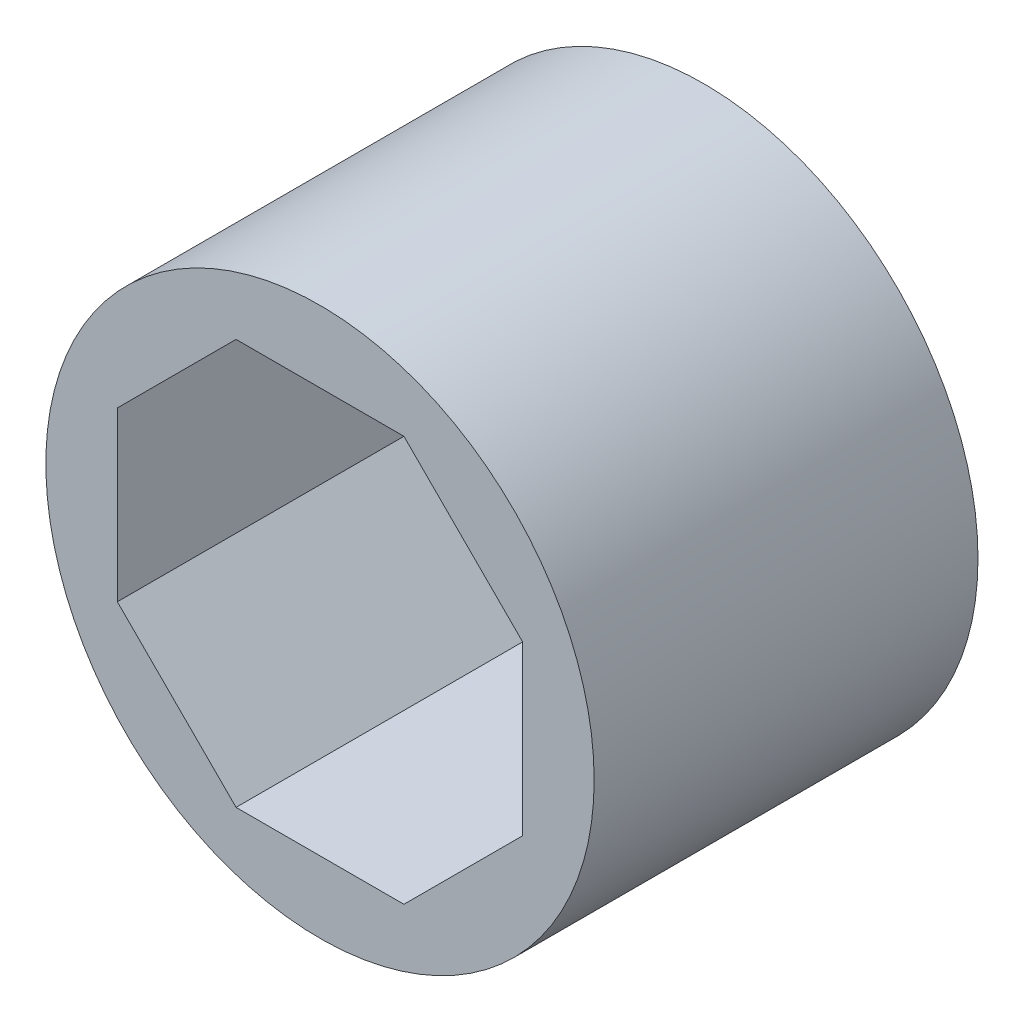
ISO-10303-21;
HEADER;
FILE_DESCRIPTION(('STEP AP214'),'2;1');
FILE_NAME('part.step','',(''),(''),'','','');
FILE_SCHEMA(('AUTOMOTIVE_DESIGN { 1 0 10303 214 1 1 1 1 }'));
ENDSEC;
DATA;
#1=APPLICATION_CONTEXT('core data for automotive mechanical design processes');
#2=APPLICATION_PROTOCOL_DEFINITION('international standard','automotive_design',2000,#1);
#3=PRODUCT_CONTEXT('',#1,'mechanical');
#4=PRODUCT('Part','Part','',(#3));
#5=PRODUCT_RELATED_PRODUCT_CATEGORY('part','',(#4));
#6=PRODUCT_DEFINITION_FORMATION('','',#4);
#7=PRODUCT_DEFINITION_CONTEXT('part definition',#1,'design');
#8=PRODUCT_DEFINITION('design','',#6,#7);
#9=PRODUCT_DEFINITION_SHAPE('','',#8);
#10=(LENGTH_UNIT() NAMED_UNIT(*) SI_UNIT(.MILLI.,.METRE.));
#11=(NAMED_UNIT(*) PLANE_ANGLE_UNIT() SI_UNIT($,.RADIAN.));
#12=(NAMED_UNIT(*) SI_UNIT($,.STERADIAN.) SOLID_ANGLE_UNIT());
#13=UNCERTAINTY_MEASURE_WITH_UNIT(LENGTH_MEASURE(1.E-05),#10,'distance_accuracy_value','');
#14=(GEOMETRIC_REPRESENTATION_CONTEXT(3) GLOBAL_UNCERTAINTY_ASSIGNED_CONTEXT((#13)) GLOBAL_UNIT_ASSIGNED_CONTEXT((#10,
#11,#12)) REPRESENTATION_CONTEXT('',''));
#15=CARTESIAN_POINT('',(0.,0.,0.));
#16=DIRECTION('',(0.,0.,1.));
#17=DIRECTION('',(1.,0.,0.));
#18=AXIS2_PLACEMENT_3D('',#15,#16,#17);
#19=CARTESIAN_POINT('',(0.,0.,7.));
#20=DIRECTION('',(0.,0.,1.));
#21=DIRECTION('',(1.,0.,0.));
#22=AXIS2_PLACEMENT_3D('',#19,#20,#21);
#23=PLANE('',#22);
#24=CARTESIAN_POINT('',(0.,0.,7.));
#25=DIRECTION('',(0.,0.,1.));
#26=DIRECTION('',(1.,0.,0.));
#27=AXIS2_PLACEMENT_3D('',#24,#25,#26);
#28=CIRCLE('',#27,5.);
#29=CARTESIAN_POINT('',(5.,0.,7.));
#30=VERTEX_POINT('',#29);
#31=EDGE_CURVE('E11',#30,#30,#28,.T.);
#32=ORIENTED_EDGE('',*,*,#31,.T.);
#33=EDGE_LOOP('',(#32));
#34=FACE_BOUND('',#33,.T.);
#35=DIRECTION('',(-1.,0.,0.));
#36=VECTOR('',#35,1.);
#37=CARTESIAN_POINT('',(1.53073372946036,3.69551813004515,7.));
#38=LINE('',#37,#36);
#39=CARTESIAN_POINT('',(1.53073372946036,3.69551813004515,7.));
#40=VERTEX_POINT('',#39);
#41=CARTESIAN_POINT('',(-1.53073372946036,3.69551813004515,7.));
#42=VERTEX_POINT('',#41);
#43=EDGE_CURVE('E114',#40,#42,#38,.T.);
#44=ORIENTED_EDGE('',*,*,#43,.F.);
#45=DIRECTION('',(-0.707106781186548,0.707106781186548,0.));
#46=VECTOR('',#45,1.);
#47=CARTESIAN_POINT('',(3.69551813004515,1.53073372946036,7.));
#48=LINE('',#47,#46);
#49=CARTESIAN_POINT('',(3.69551813004515,1.53073372946036,7.));
#50=VERTEX_POINT('',#49);
#51=EDGE_CURVE('E105',#50,#40,#48,.T.);
#52=ORIENTED_EDGE('',*,*,#51,.F.);
#53=DIRECTION('',(0.,1.,0.));
#54=VECTOR('',#53,1.);
#55=CARTESIAN_POINT('',(3.69551813004515,-1.53073372946036,7.));
#56=LINE('',#55,#54);
#57=CARTESIAN_POINT('',(3.69551813004515,-1.53073372946036,7.));
#58=VERTEX_POINT('',#57);
#59=EDGE_CURVE('E145',#58,#50,#56,.T.);
#60=ORIENTED_EDGE('',*,*,#59,.F.);
#61=DIRECTION('',(0.707106781186548,0.707106781186547,0.));
#62=VECTOR('',#61,1.);
#63=CARTESIAN_POINT('',(1.53073372946036,-3.69551813004515,7.));
#64=LINE('',#63,#62);
#65=CARTESIAN_POINT('',(1.53073372946036,-3.69551813004515,7.));
#66=VERTEX_POINT('',#65);
#67=EDGE_CURVE('E142',#66,#58,#64,.T.);
#68=ORIENTED_EDGE('',*,*,#67,.F.);
#69=DIRECTION('',(1.,0.,0.));
#70=VECTOR('',#69,1.);
#71=CARTESIAN_POINT('',(-1.53073372946036,-3.69551813004515,7.));
#72=LINE('',#71,#70);
#73=CARTESIAN_POINT('',(-1.53073372946036,-3.69551813004515,7.));
#74=VERTEX_POINT('',#73);
#75=EDGE_CURVE('E139',#74,#66,#72,.T.);
#76=ORIENTED_EDGE('',*,*,#75,.F.);
#77=DIRECTION('',(0.707106781186548,-0.707106781186547,0.));
#78=VECTOR('',#77,1.);
#79=CARTESIAN_POINT('',(-3.69551813004515,-1.53073372946036,7.));
#80=LINE('',#79,#78);
#81=CARTESIAN_POINT('',(-3.69551813004515,-1.53073372946036,7.));
#82=VERTEX_POINT('',#81);
#83=EDGE_CURVE('E136',#82,#74,#80,.T.);
#84=ORIENTED_EDGE('',*,*,#83,.F.);
#85=DIRECTION('',(0.,-1.,0.));
#86=VECTOR('',#85,1.);
#87=CARTESIAN_POINT('',(-3.69551813004515,1.53073372946036,7.));
#88=LINE('',#87,#86);
#89=CARTESIAN_POINT('',(-3.69551813004515,1.53073372946036,7.));
#90=VERTEX_POINT('',#89);
#91=EDGE_CURVE('E131',#90,#82,#88,.T.);
#92=ORIENTED_EDGE('',*,*,#91,.F.);
#93=DIRECTION('',(-0.707106781186547,-0.707106781186548,0.));
#94=VECTOR('',#93,1.);
#95=CARTESIAN_POINT('',(-1.53073372946036,3.69551813004515,7.));
#96=LINE('',#95,#94);
#97=EDGE_CURVE('E127',#42,#90,#96,.T.);
#98=ORIENTED_EDGE('',*,*,#97,.F.);
#99=EDGE_LOOP('',(#44,#52,#60,#68,#76,#84,#92,#98));
#100=FACE_BOUND('',#99,.T.);
#101=ADVANCED_FACE('F39',(#34,#100),#23,.T.);
#102=CARTESIAN_POINT('',(0.,0.,0.));
#103=DIRECTION('',(0.,0.,1.));
#104=DIRECTION('',(1.,0.,0.));
#105=AXIS2_PLACEMENT_3D('',#102,#103,#104);
#106=PLANE('',#105);
#107=CARTESIAN_POINT('',(0.,0.,0.));
#108=DIRECTION('',(0.,0.,1.));
#109=DIRECTION('',(1.,0.,0.));
#110=AXIS2_PLACEMENT_3D('',#107,#108,#109);
#111=CIRCLE('',#110,5.);
#112=CARTESIAN_POINT('',(5.,0.,0.));
#113=VERTEX_POINT('',#112);
#114=EDGE_CURVE('E43',#113,#113,#111,.T.);
#115=ORIENTED_EDGE('',*,*,#114,.F.);
#116=EDGE_LOOP('',(#115));
#117=FACE_BOUND('',#116,.T.);
#118=DIRECTION('',(-0.707106781186548,0.707106781186548,0.));
#119=VECTOR('',#118,1.);
#120=CARTESIAN_POINT('',(3.69551813004515,1.53073372946036,0.));
#121=LINE('',#120,#119);
#122=CARTESIAN_POINT('',(3.69551813004515,1.53073372946036,0.));
#123=VERTEX_POINT('',#122);
#124=CARTESIAN_POINT('',(1.53073372946036,3.69551813004515,0.));
#125=VERTEX_POINT('',#124);
#126=EDGE_CURVE('E63',#123,#125,#121,.T.);
#127=ORIENTED_EDGE('',*,*,#126,.T.);
#128=DIRECTION('',(-1.,0.,0.));
#129=VECTOR('',#128,1.);
#130=CARTESIAN_POINT('',(1.53073372946036,3.69551813004515,0.));
#131=LINE('',#130,#129);
#132=CARTESIAN_POINT('',(-1.53073372946036,3.69551813004515,0.));
#133=VERTEX_POINT('',#132);
#134=EDGE_CURVE('E121',#125,#133,#131,.T.);
#135=ORIENTED_EDGE('',*,*,#134,.T.);
#136=DIRECTION('',(-0.707106781186547,-0.707106781186548,0.));
#137=VECTOR('',#136,1.);
#138=CARTESIAN_POINT('',(-1.53073372946036,3.69551813004515,0.));
#139=LINE('',#138,#137);
#140=CARTESIAN_POINT('',(-3.69551813004515,1.53073372946036,0.));
#141=VERTEX_POINT('',#140);
#142=EDGE_CURVE('E152',#133,#141,#139,.T.);
#143=ORIENTED_EDGE('',*,*,#142,.T.);
#144=DIRECTION('',(0.,-1.,0.));
#145=VECTOR('',#144,1.);
#146=CARTESIAN_POINT('',(-3.69551813004515,1.53073372946036,0.));
#147=LINE('',#146,#145);
#148=CARTESIAN_POINT('',(-3.69551813004515,-1.53073372946036,0.));
#149=VERTEX_POINT('',#148);
#150=EDGE_CURVE('E156',#141,#149,#147,.T.);
#151=ORIENTED_EDGE('',*,*,#150,.T.);
#152=DIRECTION('',(0.707106781186548,-0.707106781186547,0.));
#153=VECTOR('',#152,1.);
#154=CARTESIAN_POINT('',(-3.69551813004515,-1.53073372946036,0.));
#155=LINE('',#154,#153);
#156=CARTESIAN_POINT('',(-1.53073372946036,-3.69551813004515,0.));
#157=VERTEX_POINT('',#156);
#158=EDGE_CURVE('E160',#149,#157,#155,.T.);
#159=ORIENTED_EDGE('',*,*,#158,.T.);
#160=DIRECTION('',(1.,0.,0.));
#161=VECTOR('',#160,1.);
#162=CARTESIAN_POINT('',(-1.53073372946036,-3.69551813004515,0.));
#163=LINE('',#162,#161);
#164=CARTESIAN_POINT('',(1.53073372946036,-3.69551813004515,0.));
#165=VERTEX_POINT('',#164);
#166=EDGE_CURVE('E164',#157,#165,#163,.T.);
#167=ORIENTED_EDGE('',*,*,#166,.T.);
#168=DIRECTION('',(0.707106781186548,0.707106781186547,0.));
#169=VECTOR('',#168,1.);
#170=CARTESIAN_POINT('',(1.53073372946036,-3.69551813004515,0.));
#171=LINE('',#170,#169);
#172=CARTESIAN_POINT('',(3.69551813004515,-1.53073372946036,0.));
#173=VERTEX_POINT('',#172);
#174=EDGE_CURVE('E168',#165,#173,#171,.T.);
#175=ORIENTED_EDGE('',*,*,#174,.T.);
#176=DIRECTION('',(0.,1.,0.));
#177=VECTOR('',#176,1.);
#178=CARTESIAN_POINT('',(3.69551813004515,-1.53073372946036,0.));
#179=LINE('',#178,#177);
#180=EDGE_CURVE('E115',#173,#123,#179,.T.);
#181=ORIENTED_EDGE('',*,*,#180,.T.);
#182=EDGE_LOOP('',(#127,#135,#143,#151,#159,#167,#175,#181));
#183=FACE_BOUND('',#182,.T.);
#184=ADVANCED_FACE('F198',(#117,#183),#106,.F.);
#185=CARTESIAN_POINT('',(0.,0.,7.));
#186=DIRECTION('',(0.,0.,-1.));
#187=DIRECTION('',(-1.,0.,0.));
#188=AXIS2_PLACEMENT_3D('',#185,#186,#187);
#189=CYLINDRICAL_SURFACE('',#188,5.);
#190=ORIENTED_EDGE('',*,*,#31,.F.);
#191=EDGE_LOOP('',(#190));
#192=FACE_BOUND('',#191,.T.);
#193=ORIENTED_EDGE('',*,*,#114,.T.);
#194=EDGE_LOOP('',(#193));
#195=FACE_BOUND('',#194,.T.);
#196=ADVANCED_FACE('F41',(#192,#195),#189,.T.);
#197=CARTESIAN_POINT('',(3.69551813004515,1.53073372946036,7.));
#198=DIRECTION('',(-0.707106781186547,-0.707106781186547,0.));
#199=DIRECTION('',(0.707106781186548,-0.707106781186548,0.));
#200=AXIS2_PLACEMENT_3D('',#197,#198,#199);
#201=PLANE('',#200);
#202=ORIENTED_EDGE('',*,*,#126,.F.);
#203=DIRECTION('',(0.,0.,-1.));
#204=VECTOR('',#203,1.);
#205=CARTESIAN_POINT('',(3.69551813004515,1.53073372946036,7.));
#206=LINE('',#205,#204);
#207=EDGE_CURVE('E109',#50,#123,#206,.T.);
#208=ORIENTED_EDGE('',*,*,#207,.F.);
#209=ORIENTED_EDGE('',*,*,#51,.T.);
#210=DIRECTION('',(0.,0.,-1.));
#211=VECTOR('',#210,1.);
#212=CARTESIAN_POINT('',(1.53073372946036,3.69551813004515,7.));
#213=LINE('',#212,#211);
#214=EDGE_CURVE('E108',#40,#125,#213,.T.);
#215=ORIENTED_EDGE('',*,*,#214,.T.);
#216=EDGE_LOOP('',(#202,#208,#209,#215));
#217=FACE_BOUND('',#216,.T.);
#218=ADVANCED_FACE('F107',(#217),#201,.T.);
#219=CARTESIAN_POINT('',(1.53073372946036,3.69551813004515,7.));
#220=DIRECTION('',(0.,-1.,0.));
#221=DIRECTION('',(1.,0.,0.));
#222=AXIS2_PLACEMENT_3D('',#219,#220,#221);
#223=PLANE('',#222);
#224=ORIENTED_EDGE('',*,*,#134,.F.);
#225=ORIENTED_EDGE('',*,*,#214,.F.);
#226=ORIENTED_EDGE('',*,*,#43,.T.);
#227=DIRECTION('',(0.,0.,-1.));
#228=VECTOR('',#227,1.);
#229=CARTESIAN_POINT('',(-1.53073372946036,3.69551813004515,7.));
#230=LINE('',#229,#228);
#231=EDGE_CURVE('E123',#42,#133,#230,.T.);
#232=ORIENTED_EDGE('',*,*,#231,.T.);
#233=EDGE_LOOP('',(#224,#225,#226,#232));
#234=FACE_BOUND('',#233,.T.);
#235=ADVANCED_FACE('F118',(#234),#223,.T.);
#236=CARTESIAN_POINT('',(-1.53073372946036,3.69551813004515,7.));
#237=DIRECTION('',(0.707106781186548,-0.707106781186547,0.));
#238=DIRECTION('',(0.707106781186547,0.707106781186548,0.));
#239=AXIS2_PLACEMENT_3D('',#236,#237,#238);
#240=PLANE('',#239);
#241=ORIENTED_EDGE('',*,*,#142,.F.);
#242=ORIENTED_EDGE('',*,*,#231,.F.);
#243=ORIENTED_EDGE('',*,*,#97,.T.);
#244=DIRECTION('',(0.,0.,-1.));
#245=VECTOR('',#244,1.);
#246=CARTESIAN_POINT('',(-3.69551813004515,1.53073372946036,7.));
#247=LINE('',#246,#245);
#248=EDGE_CURVE('E188',#90,#141,#247,.T.);
#249=ORIENTED_EDGE('',*,*,#248,.T.);
#250=EDGE_LOOP('',(#241,#242,#243,#249));
#251=FACE_BOUND('',#250,.T.);
#252=ADVANCED_FACE('F194',(#251),#240,.T.);
#253=CARTESIAN_POINT('',(-3.69551813004515,1.53073372946036,7.));
#254=DIRECTION('',(1.,0.,0.));
#255=DIRECTION('',(0.,1.,0.));
#256=AXIS2_PLACEMENT_3D('',#253,#254,#255);
#257=PLANE('',#256);
#258=ORIENTED_EDGE('',*,*,#150,.F.);
#259=ORIENTED_EDGE('',*,*,#248,.F.);
#260=ORIENTED_EDGE('',*,*,#91,.T.);
#261=DIRECTION('',(0.,0.,-1.));
#262=VECTOR('',#261,1.);
#263=CARTESIAN_POINT('',(-3.69551813004515,-1.53073372946036,7.));
#264=LINE('',#263,#262);
#265=EDGE_CURVE('E185',#82,#149,#264,.T.);
#266=ORIENTED_EDGE('',*,*,#265,.T.);
#267=EDGE_LOOP('',(#258,#259,#260,#266));
#268=FACE_BOUND('',#267,.T.);
#269=ADVANCED_FACE('F216',(#268),#257,.T.);
#270=CARTESIAN_POINT('',(-3.69551813004515,-1.53073372946036,7.));
#271=DIRECTION('',(0.707106781186547,0.707106781186548,0.));
#272=DIRECTION('',(-0.707106781186548,0.707106781186547,0.));
#273=AXIS2_PLACEMENT_3D('',#270,#271,#272);
#274=PLANE('',#273);
#275=ORIENTED_EDGE('',*,*,#158,.F.);
#276=ORIENTED_EDGE('',*,*,#265,.F.);
#277=ORIENTED_EDGE('',*,*,#83,.T.);
#278=DIRECTION('',(0.,0.,-1.));
#279=VECTOR('',#278,1.);
#280=CARTESIAN_POINT('',(-1.53073372946036,-3.69551813004515,7.));
#281=LINE('',#280,#279);
#282=EDGE_CURVE('E182',#74,#157,#281,.T.);
#283=ORIENTED_EDGE('',*,*,#282,.T.);
#284=EDGE_LOOP('',(#275,#276,#277,#283));
#285=FACE_BOUND('',#284,.T.);
#286=ADVANCED_FACE('F213',(#285),#274,.T.);
#287=CARTESIAN_POINT('',(-1.53073372946036,-3.69551813004515,7.));
#288=DIRECTION('',(0.,1.,0.));
#289=DIRECTION('',(-1.,0.,0.));
#290=AXIS2_PLACEMENT_3D('',#287,#288,#289);
#291=PLANE('',#290);
#292=ORIENTED_EDGE('',*,*,#166,.F.);
#293=ORIENTED_EDGE('',*,*,#282,.F.);
#294=ORIENTED_EDGE('',*,*,#75,.T.);
#295=DIRECTION('',(0.,0.,-1.));
#296=VECTOR('',#295,1.);
#297=CARTESIAN_POINT('',(1.53073372946036,-3.69551813004515,7.));
#298=LINE('',#297,#296);
#299=EDGE_CURVE('E179',#66,#165,#298,.T.);
#300=ORIENTED_EDGE('',*,*,#299,.T.);
#301=EDGE_LOOP('',(#292,#293,#294,#300));
#302=FACE_BOUND('',#301,.T.);
#303=ADVANCED_FACE('F209',(#302),#291,.T.);
#304=CARTESIAN_POINT('',(1.53073372946036,-3.69551813004515,7.));
#305=DIRECTION('',(-0.707106781186547,0.707106781186548,0.));
#306=DIRECTION('',(-0.707106781186548,-0.707106781186547,0.));
#307=AXIS2_PLACEMENT_3D('',#304,#305,#306);
#308=PLANE('',#307);
#309=ORIENTED_EDGE('',*,*,#174,.F.);
#310=ORIENTED_EDGE('',*,*,#299,.F.);
#311=ORIENTED_EDGE('',*,*,#67,.T.);
#312=DIRECTION('',(0.,0.,-1.));
#313=VECTOR('',#312,1.);
#314=CARTESIAN_POINT('',(3.69551813004515,-1.53073372946036,7.));
#315=LINE('',#314,#313);
#316=EDGE_CURVE('E55',#58,#173,#315,.T.);
#317=ORIENTED_EDGE('',*,*,#316,.T.);
#318=EDGE_LOOP('',(#309,#310,#311,#317));
#319=FACE_BOUND('',#318,.T.);
#320=ADVANCED_FACE('F206',(#319),#308,.T.);
#321=CARTESIAN_POINT('',(3.69551813004515,-1.53073372946036,7.));
#322=DIRECTION('',(-1.,0.,0.));
#323=DIRECTION('',(0.,-1.,0.));
#324=AXIS2_PLACEMENT_3D('',#321,#322,#323);
#325=PLANE('',#324);
#326=ORIENTED_EDGE('',*,*,#180,.F.);
#327=ORIENTED_EDGE('',*,*,#316,.F.);
#328=ORIENTED_EDGE('',*,*,#59,.T.);
#329=ORIENTED_EDGE('',*,*,#207,.T.);
#330=EDGE_LOOP('',(#326,#327,#328,#329));
#331=FACE_BOUND('',#330,.T.);
#332=ADVANCED_FACE('F200',(#331),#325,.T.);
#333=CLOSED_SHELL('',(#101,#184,#196,#218,#235,#252,#269,#286,#303,#320,#332));
#334=MANIFOLD_SOLID_BREP('B2',#333);
#335=ADVANCED_BREP_SHAPE_REPRESENTATION('',(#18,#334),#14);
#336=SHAPE_DEFINITION_REPRESENTATION(#9,#335);
ENDSEC;
END-ISO-10303-21;
